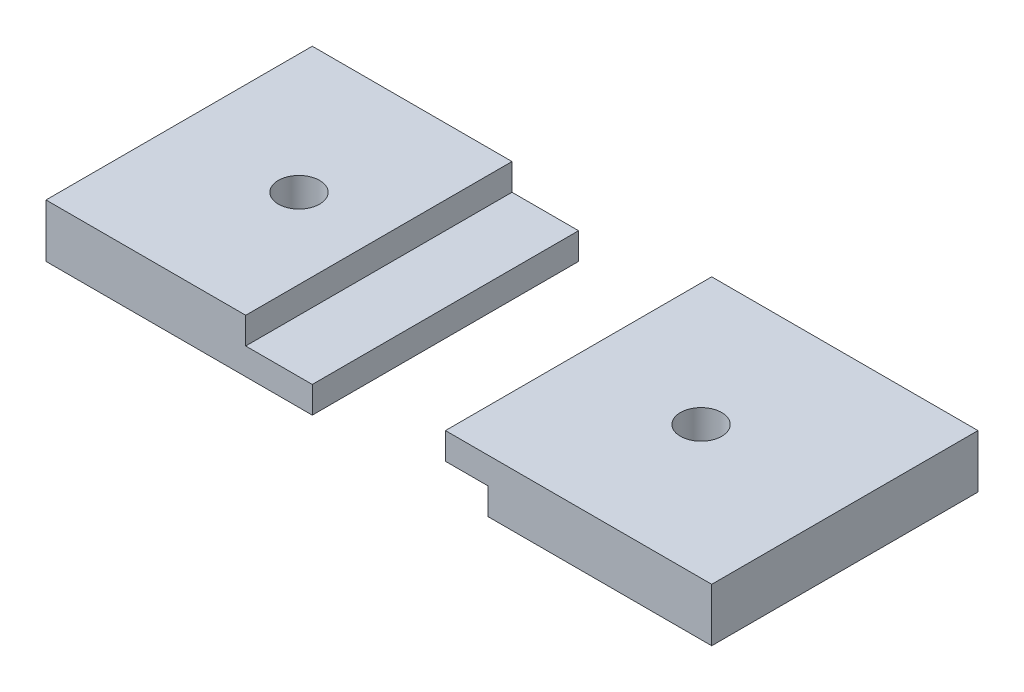
ISO-10303-21;
HEADER;
FILE_DESCRIPTION(('STEP AP214'),'2;1');
FILE_NAME('part.step','',(''),(''),'','','');
FILE_SCHEMA(('AUTOMOTIVE_DESIGN { 1 0 10303 214 1 1 1 1 }'));
ENDSEC;
DATA;
#1=APPLICATION_CONTEXT('core data for automotive mechanical design processes');
#2=APPLICATION_PROTOCOL_DEFINITION('international standard','automotive_design',2000,#1);
#3=PRODUCT_CONTEXT('',#1,'mechanical');
#4=PRODUCT('Part','Part','',(#3));
#5=PRODUCT_RELATED_PRODUCT_CATEGORY('part','',(#4));
#6=PRODUCT_DEFINITION_FORMATION('','',#4);
#7=PRODUCT_DEFINITION_CONTEXT('part definition',#1,'design');
#8=PRODUCT_DEFINITION('design','',#6,#7);
#9=PRODUCT_DEFINITION_SHAPE('','',#8);
#10=(LENGTH_UNIT() NAMED_UNIT(*) SI_UNIT(.MILLI.,.METRE.));
#11=(NAMED_UNIT(*) PLANE_ANGLE_UNIT() SI_UNIT($,.RADIAN.));
#12=(NAMED_UNIT(*) SI_UNIT($,.STERADIAN.) SOLID_ANGLE_UNIT());
#13=UNCERTAINTY_MEASURE_WITH_UNIT(LENGTH_MEASURE(1.E-05),#10,'distance_accuracy_value','');
#14=(GEOMETRIC_REPRESENTATION_CONTEXT(3) GLOBAL_UNCERTAINTY_ASSIGNED_CONTEXT((#13)) GLOBAL_UNIT_ASSIGNED_CONTEXT((#10,
#11,#12)) REPRESENTATION_CONTEXT('',''));
#15=CARTESIAN_POINT('',(0.,0.,0.));
#16=DIRECTION('',(0.,0.,1.));
#17=DIRECTION('',(1.,0.,0.));
#18=AXIS2_PLACEMENT_3D('',#15,#16,#17);
#19=CARTESIAN_POINT('',(10.,4.,0.));
#20=DIRECTION('',(1.,0.,0.));
#21=DIRECTION('',(0.,0.,-1.));
#22=AXIS2_PLACEMENT_3D('',#19,#20,#21);
#23=PLANE('',#22);
#24=DIRECTION('',(0.,-1.,0.));
#25=VECTOR('',#24,1.);
#26=CARTESIAN_POINT('',(10.,4.,-20.));
#27=LINE('',#26,#25);
#28=CARTESIAN_POINT('',(10.,4.,-20.));
#29=VERTEX_POINT('',#28);
#30=CARTESIAN_POINT('',(10.,2.,-20.));
#31=VERTEX_POINT('',#30);
#32=EDGE_CURVE('E135',#29,#31,#27,.T.);
#33=ORIENTED_EDGE('',*,*,#32,.T.);
#34=DIRECTION('',(0.,0.,-1.));
#35=VECTOR('',#34,1.);
#36=CARTESIAN_POINT('',(10.,2.,-20.));
#37=LINE('',#36,#35);
#38=CARTESIAN_POINT('',(10.,2.,0.));
#39=VERTEX_POINT('',#38);
#40=EDGE_CURVE('E146',#39,#31,#37,.T.);
#41=ORIENTED_EDGE('',*,*,#40,.F.);
#42=DIRECTION('',(0.,-1.,0.));
#43=VECTOR('',#42,1.);
#44=CARTESIAN_POINT('',(10.,4.,0.));
#45=LINE('',#44,#43);
#46=CARTESIAN_POINT('',(10.,4.,0.));
#47=VERTEX_POINT('',#46);
#48=EDGE_CURVE('E12',#47,#39,#45,.T.);
#49=ORIENTED_EDGE('',*,*,#48,.F.);
#50=DIRECTION('',(0.,0.,1.));
#51=VECTOR('',#50,1.);
#52=CARTESIAN_POINT('',(10.,4.,0.));
#53=LINE('',#52,#51);
#54=EDGE_CURVE('E134',#29,#47,#53,.T.);
#55=ORIENTED_EDGE('',*,*,#54,.F.);
#56=EDGE_LOOP('',(#33,#41,#49,#55));
#57=FACE_BOUND('',#56,.T.);
#58=ADVANCED_FACE('F47',(#57),#23,.F.);
#59=CARTESIAN_POINT('',(10.,4.,0.));
#60=DIRECTION('',(0.,0.,-1.));
#61=DIRECTION('',(-1.,0.,0.));
#62=AXIS2_PLACEMENT_3D('',#59,#60,#61);
#63=PLANE('',#62);
#64=ORIENTED_EDGE('',*,*,#48,.T.);
#65=DIRECTION('',(-1.,0.,0.));
#66=VECTOR('',#65,1.);
#67=CARTESIAN_POINT('',(13.2,2.,0.));
#68=LINE('',#67,#66);
#69=CARTESIAN_POINT('',(13.2,2.,0.));
#70=VERTEX_POINT('',#69);
#71=EDGE_CURVE('E120',#70,#39,#68,.T.);
#72=ORIENTED_EDGE('',*,*,#71,.F.);
#73=DIRECTION('',(0.,1.,0.));
#74=VECTOR('',#73,1.);
#75=CARTESIAN_POINT('',(13.2,0.,0.));
#76=LINE('',#75,#74);
#77=CARTESIAN_POINT('',(13.2,0.,0.));
#78=VERTEX_POINT('',#77);
#79=EDGE_CURVE('E110',#78,#70,#76,.T.);
#80=ORIENTED_EDGE('',*,*,#79,.F.);
#81=DIRECTION('',(1.,0.,0.));
#82=VECTOR('',#81,1.);
#83=CARTESIAN_POINT('',(10.,0.,0.));
#84=LINE('',#83,#82);
#85=CARTESIAN_POINT('',(30.,0.,0.));
#86=VERTEX_POINT('',#85);
#87=EDGE_CURVE('E119',#78,#86,#84,.T.);
#88=ORIENTED_EDGE('',*,*,#87,.T.);
#89=DIRECTION('',(0.,-1.,0.));
#90=VECTOR('',#89,1.);
#91=CARTESIAN_POINT('',(30.,4.,0.));
#92=LINE('',#91,#90);
#93=CARTESIAN_POINT('',(30.,4.,0.));
#94=VERTEX_POINT('',#93);
#95=EDGE_CURVE('E54',#94,#86,#92,.T.);
#96=ORIENTED_EDGE('',*,*,#95,.F.);
#97=DIRECTION('',(1.,0.,0.));
#98=VECTOR('',#97,1.);
#99=CARTESIAN_POINT('',(10.,4.,0.));
#100=LINE('',#99,#98);
#101=EDGE_CURVE('E93',#47,#94,#100,.T.);
#102=ORIENTED_EDGE('',*,*,#101,.F.);
#103=EDGE_LOOP('',(#64,#72,#80,#88,#96,#102));
#104=FACE_BOUND('',#103,.T.);
#105=ADVANCED_FACE('F118',(#104),#63,.F.);
#106=CARTESIAN_POINT('',(30.,4.,0.));
#107=DIRECTION('',(-1.,0.,0.));
#108=DIRECTION('',(0.,0.,1.));
#109=AXIS2_PLACEMENT_3D('',#106,#107,#108);
#110=PLANE('',#109);
#111=DIRECTION('',(0.,0.,-1.));
#112=VECTOR('',#111,1.);
#113=CARTESIAN_POINT('',(30.,0.,0.));
#114=LINE('',#113,#112);
#115=CARTESIAN_POINT('',(30.,0.,-20.));
#116=VERTEX_POINT('',#115);
#117=EDGE_CURVE('E86',#86,#116,#114,.T.);
#118=ORIENTED_EDGE('',*,*,#117,.T.);
#119=DIRECTION('',(0.,-1.,0.));
#120=VECTOR('',#119,1.);
#121=CARTESIAN_POINT('',(30.,4.,-20.));
#122=LINE('',#121,#120);
#123=CARTESIAN_POINT('',(30.,4.,-20.));
#124=VERTEX_POINT('',#123);
#125=EDGE_CURVE('E138',#124,#116,#122,.T.);
#126=ORIENTED_EDGE('',*,*,#125,.F.);
#127=DIRECTION('',(0.,0.,-1.));
#128=VECTOR('',#127,1.);
#129=CARTESIAN_POINT('',(30.,4.,0.));
#130=LINE('',#129,#128);
#131=EDGE_CURVE('E141',#94,#124,#130,.T.);
#132=ORIENTED_EDGE('',*,*,#131,.F.);
#133=ORIENTED_EDGE('',*,*,#95,.T.);
#134=EDGE_LOOP('',(#118,#126,#132,#133));
#135=FACE_BOUND('',#134,.T.);
#136=ADVANCED_FACE('F140',(#135),#110,.F.);
#137=CARTESIAN_POINT('',(10.,4.,-20.));
#138=DIRECTION('',(0.,0.,1.));
#139=DIRECTION('',(1.,0.,0.));
#140=AXIS2_PLACEMENT_3D('',#137,#138,#139);
#141=PLANE('',#140);
#142=DIRECTION('',(0.,-1.,0.));
#143=VECTOR('',#142,1.);
#144=CARTESIAN_POINT('',(13.2,0.,-20.));
#145=LINE('',#144,#143);
#146=CARTESIAN_POINT('',(13.2,2.,-20.));
#147=VERTEX_POINT('',#146);
#148=CARTESIAN_POINT('',(13.2,0.,-20.));
#149=VERTEX_POINT('',#148);
#150=EDGE_CURVE('E61',#147,#149,#145,.T.);
#151=ORIENTED_EDGE('',*,*,#150,.F.);
#152=DIRECTION('',(-1.,0.,0.));
#153=VECTOR('',#152,1.);
#154=CARTESIAN_POINT('',(13.2,2.,-20.));
#155=LINE('',#154,#153);
#156=EDGE_CURVE('E124',#147,#31,#155,.T.);
#157=ORIENTED_EDGE('',*,*,#156,.T.);
#158=ORIENTED_EDGE('',*,*,#32,.F.);
#159=DIRECTION('',(-1.,0.,0.));
#160=VECTOR('',#159,1.);
#161=CARTESIAN_POINT('',(10.,4.,-20.));
#162=LINE('',#161,#160);
#163=EDGE_CURVE('E70',#124,#29,#162,.T.);
#164=ORIENTED_EDGE('',*,*,#163,.F.);
#165=ORIENTED_EDGE('',*,*,#125,.T.);
#166=DIRECTION('',(-1.,0.,0.));
#167=VECTOR('',#166,1.);
#168=CARTESIAN_POINT('',(10.,0.,-20.));
#169=LINE('',#168,#167);
#170=EDGE_CURVE('E126',#116,#149,#169,.T.);
#171=ORIENTED_EDGE('',*,*,#170,.T.);
#172=EDGE_LOOP('',(#151,#157,#158,#164,#165,#171));
#173=FACE_BOUND('',#172,.T.);
#174=ADVANCED_FACE('F166',(#173),#141,.F.);
#175=CARTESIAN_POINT('',(0.,4.,0.));
#176=DIRECTION('',(0.,-1.,0.));
#177=DIRECTION('',(0.,0.,-1.));
#178=AXIS2_PLACEMENT_3D('',#175,#176,#177);
#179=PLANE('',#178);
#180=CARTESIAN_POINT('',(19.2,4.,-10.));
#181=DIRECTION('',(0.,1.,0.));
#182=DIRECTION('',(0.,0.,1.));
#183=AXIS2_PLACEMENT_3D('',#180,#181,#182);
#184=CIRCLE('',#183,1.55);
#185=CARTESIAN_POINT('',(19.2,4.,-8.45000000000001));
#186=VERTEX_POINT('',#185);
#187=EDGE_CURVE('E151',#186,#186,#184,.T.);
#188=ORIENTED_EDGE('',*,*,#187,.F.);
#189=EDGE_LOOP('',(#188));
#190=FACE_BOUND('',#189,.T.);
#191=ORIENTED_EDGE('',*,*,#54,.T.);
#192=ORIENTED_EDGE('',*,*,#101,.T.);
#193=ORIENTED_EDGE('',*,*,#131,.T.);
#194=ORIENTED_EDGE('',*,*,#163,.T.);
#195=EDGE_LOOP('',(#191,#192,#193,#194));
#196=FACE_BOUND('',#195,.T.);
#197=ADVANCED_FACE('F164',(#190,#196),#179,.F.);
#198=CARTESIAN_POINT('',(0.,0.,0.));
#199=DIRECTION('',(0.,-1.,0.));
#200=DIRECTION('',(0.,0.,-1.));
#201=AXIS2_PLACEMENT_3D('',#198,#199,#200);
#202=PLANE('',#201);
#203=CARTESIAN_POINT('',(19.2,0.,-10.));
#204=DIRECTION('',(0.,1.,0.));
#205=DIRECTION('',(0.,0.,1.));
#206=AXIS2_PLACEMENT_3D('',#203,#204,#205);
#207=CIRCLE('',#206,1.55);
#208=CARTESIAN_POINT('',(19.2,0.,-8.45000000000001));
#209=VERTEX_POINT('',#208);
#210=EDGE_CURVE('E148',#209,#209,#207,.T.);
#211=ORIENTED_EDGE('',*,*,#210,.T.);
#212=EDGE_LOOP('',(#211));
#213=FACE_BOUND('',#212,.T.);
#214=DIRECTION('',(0.,0.,1.));
#215=VECTOR('',#214,1.);
#216=CARTESIAN_POINT('',(13.2,0.,-20.));
#217=LINE('',#216,#215);
#218=EDGE_CURVE('E107',#149,#78,#217,.T.);
#219=ORIENTED_EDGE('',*,*,#218,.F.);
#220=ORIENTED_EDGE('',*,*,#170,.F.);
#221=ORIENTED_EDGE('',*,*,#117,.F.);
#222=ORIENTED_EDGE('',*,*,#87,.F.);
#223=EDGE_LOOP('',(#219,#220,#221,#222));
#224=FACE_BOUND('',#223,.T.);
#225=ADVANCED_FACE('F123',(#213,#224),#202,.T.);
#226=CARTESIAN_POINT('',(13.2,2.,-20.));
#227=DIRECTION('',(0.,1.,0.));
#228=DIRECTION('',(0.,0.,1.));
#229=AXIS2_PLACEMENT_3D('',#226,#227,#228);
#230=PLANE('',#229);
#231=ORIENTED_EDGE('',*,*,#40,.T.);
#232=ORIENTED_EDGE('',*,*,#156,.F.);
#233=DIRECTION('',(0.,0.,-1.));
#234=VECTOR('',#233,1.);
#235=CARTESIAN_POINT('',(13.2,2.,-20.));
#236=LINE('',#235,#234);
#237=EDGE_CURVE('E121',#70,#147,#236,.T.);
#238=ORIENTED_EDGE('',*,*,#237,.F.);
#239=ORIENTED_EDGE('',*,*,#71,.T.);
#240=EDGE_LOOP('',(#231,#232,#238,#239));
#241=FACE_BOUND('',#240,.T.);
#242=ADVANCED_FACE('F173',(#241),#230,.F.);
#243=CARTESIAN_POINT('',(13.2,0.,0.));
#244=DIRECTION('',(1.,0.,0.));
#245=DIRECTION('',(0.,0.,-1.));
#246=AXIS2_PLACEMENT_3D('',#243,#244,#245);
#247=PLANE('',#246);
#248=ORIENTED_EDGE('',*,*,#150,.T.);
#249=ORIENTED_EDGE('',*,*,#218,.T.);
#250=ORIENTED_EDGE('',*,*,#79,.T.);
#251=ORIENTED_EDGE('',*,*,#237,.T.);
#252=EDGE_LOOP('',(#248,#249,#250,#251));
#253=FACE_BOUND('',#252,.T.);
#254=ADVANCED_FACE('F109',(#253),#247,.F.);
#255=CARTESIAN_POINT('',(19.2,0.,-10.));
#256=DIRECTION('',(0.,1.,0.));
#257=DIRECTION('',(0.,0.,1.));
#258=AXIS2_PLACEMENT_3D('',#255,#256,#257);
#259=CYLINDRICAL_SURFACE('',#258,1.55);
#260=ORIENTED_EDGE('',*,*,#210,.F.);
#261=EDGE_LOOP('',(#260));
#262=FACE_BOUND('',#261,.T.);
#263=ORIENTED_EDGE('',*,*,#187,.T.);
#264=EDGE_LOOP('',(#263));
#265=FACE_BOUND('',#264,.T.);
#266=ADVANCED_FACE('F158',(#262,#265),#259,.F.);
#267=CLOSED_SHELL('',(#58,#105,#136,#174,#197,#225,#242,#254,#266));
#268=MANIFOLD_SOLID_BREP('B2',#267);
#269=CARTESIAN_POINT('',(0.,4.,0.));
#270=DIRECTION('',(0.,1.,0.));
#271=DIRECTION('',(0.,0.,1.));
#272=AXIS2_PLACEMENT_3D('',#269,#270,#271);
#273=PLANE('',#272);
#274=CARTESIAN_POINT('',(-11.,4.,-10.));
#275=DIRECTION('',(0.,1.,0.));
#276=DIRECTION('',(0.,0.,1.));
#277=AXIS2_PLACEMENT_3D('',#274,#275,#276);
#278=CIRCLE('',#277,1.55);
#279=CARTESIAN_POINT('',(-11.,4.,-8.45));
#280=VERTEX_POINT('',#279);
#281=EDGE_CURVE('E357',#280,#280,#278,.T.);
#282=ORIENTED_EDGE('',*,*,#281,.F.);
#283=EDGE_LOOP('',(#282));
#284=FACE_BOUND('',#283,.T.);
#285=DIRECTION('',(1.,0.,0.));
#286=VECTOR('',#285,1.);
#287=CARTESIAN_POINT('',(0.,4.,0.));
#288=LINE('',#287,#286);
#289=CARTESIAN_POINT('',(-20.,4.,0.));
#290=VERTEX_POINT('',#289);
#291=CARTESIAN_POINT('',(-5.,4.,0.));
#292=VERTEX_POINT('',#291);
#293=EDGE_CURVE('E298',#290,#292,#288,.T.);
#294=ORIENTED_EDGE('',*,*,#293,.T.);
#295=DIRECTION('',(0.,0.,1.));
#296=VECTOR('',#295,1.);
#297=CARTESIAN_POINT('',(-5.,4.,0.));
#298=LINE('',#297,#296);
#299=CARTESIAN_POINT('',(-5.,4.,-20.));
#300=VERTEX_POINT('',#299);
#301=EDGE_CURVE('E348',#300,#292,#298,.T.);
#302=ORIENTED_EDGE('',*,*,#301,.F.);
#303=DIRECTION('',(-1.,0.,0.));
#304=VECTOR('',#303,1.);
#305=CARTESIAN_POINT('',(0.,4.,-20.));
#306=LINE('',#305,#304);
#307=CARTESIAN_POINT('',(-20.,4.,-20.));
#308=VERTEX_POINT('',#307);
#309=EDGE_CURVE('E307',#300,#308,#306,.T.);
#310=ORIENTED_EDGE('',*,*,#309,.T.);
#311=DIRECTION('',(0.,0.,1.));
#312=VECTOR('',#311,1.);
#313=CARTESIAN_POINT('',(-20.,4.,0.));
#314=LINE('',#313,#312);
#315=EDGE_CURVE('E268',#308,#290,#314,.T.);
#316=ORIENTED_EDGE('',*,*,#315,.T.);
#317=EDGE_LOOP('',(#294,#302,#310,#316));
#318=FACE_BOUND('',#317,.T.);
#319=ADVANCED_FACE('F244',(#284,#318),#273,.T.);
#320=CARTESIAN_POINT('',(0.,4.,0.));
#321=DIRECTION('',(-1.,0.,0.));
#322=DIRECTION('',(0.,0.,1.));
#323=AXIS2_PLACEMENT_3D('',#320,#321,#322);
#324=PLANE('',#323);
#325=DIRECTION('',(0.,-1.,0.));
#326=VECTOR('',#325,1.);
#327=CARTESIAN_POINT('',(0.,4.,-20.));
#328=LINE('',#327,#326);
#329=CARTESIAN_POINT('',(0.,2.,-20.));
#330=VERTEX_POINT('',#329);
#331=CARTESIAN_POINT('',(0.,0.,-20.));
#332=VERTEX_POINT('',#331);
#333=EDGE_CURVE('E45',#330,#332,#328,.T.);
#334=ORIENTED_EDGE('',*,*,#333,.F.);
#335=DIRECTION('',(0.,0.,-1.));
#336=VECTOR('',#335,1.);
#337=CARTESIAN_POINT('',(0.,2.,0.));
#338=LINE('',#337,#336);
#339=CARTESIAN_POINT('',(0.,2.,0.));
#340=VERTEX_POINT('',#339);
#341=EDGE_CURVE('E294',#340,#330,#338,.T.);
#342=ORIENTED_EDGE('',*,*,#341,.F.);
#343=DIRECTION('',(0.,-1.,0.));
#344=VECTOR('',#343,1.);
#345=CARTESIAN_POINT('',(0.,4.,0.));
#346=LINE('',#345,#344);
#347=CARTESIAN_POINT('',(0.,0.,0.));
#348=VERTEX_POINT('',#347);
#349=EDGE_CURVE('E287',#340,#348,#346,.T.);
#350=ORIENTED_EDGE('',*,*,#349,.T.);
#351=DIRECTION('',(0.,0.,-1.));
#352=VECTOR('',#351,1.);
#353=CARTESIAN_POINT('',(0.,0.,0.));
#354=LINE('',#353,#352);
#355=EDGE_CURVE('E291',#348,#332,#354,.T.);
#356=ORIENTED_EDGE('',*,*,#355,.T.);
#357=EDGE_LOOP('',(#334,#342,#350,#356));
#358=FACE_BOUND('',#357,.T.);
#359=ADVANCED_FACE('F246',(#358),#324,.F.);
#360=CARTESIAN_POINT('',(0.,4.,-20.));
#361=DIRECTION('',(0.,0.,1.));
#362=DIRECTION('',(1.,0.,0.));
#363=AXIS2_PLACEMENT_3D('',#360,#361,#362);
#364=PLANE('',#363);
#365=DIRECTION('',(0.,1.,0.));
#366=VECTOR('',#365,1.);
#367=CARTESIAN_POINT('',(-5.,4.,-20.));
#368=LINE('',#367,#366);
#369=CARTESIAN_POINT('',(-5.,2.,-20.));
#370=VERTEX_POINT('',#369);
#371=EDGE_CURVE('E259',#370,#300,#368,.T.);
#372=ORIENTED_EDGE('',*,*,#371,.F.);
#373=DIRECTION('',(1.,0.,0.));
#374=VECTOR('',#373,1.);
#375=CARTESIAN_POINT('',(-5.,2.,-20.));
#376=LINE('',#375,#374);
#377=EDGE_CURVE('E313',#370,#330,#376,.T.);
#378=ORIENTED_EDGE('',*,*,#377,.T.);
#379=ORIENTED_EDGE('',*,*,#333,.T.);
#380=DIRECTION('',(-1.,0.,0.));
#381=VECTOR('',#380,1.);
#382=CARTESIAN_POINT('',(0.,0.,-20.));
#383=LINE('',#382,#381);
#384=CARTESIAN_POINT('',(-20.,0.,-20.));
#385=VERTEX_POINT('',#384);
#386=EDGE_CURVE('E312',#332,#385,#383,.T.);
#387=ORIENTED_EDGE('',*,*,#386,.T.);
#388=DIRECTION('',(0.,-1.,0.));
#389=VECTOR('',#388,1.);
#390=CARTESIAN_POINT('',(-20.,4.,-20.));
#391=LINE('',#390,#389);
#392=EDGE_CURVE('E252',#308,#385,#391,.T.);
#393=ORIENTED_EDGE('',*,*,#392,.F.);
#394=ORIENTED_EDGE('',*,*,#309,.F.);
#395=EDGE_LOOP('',(#372,#378,#379,#387,#393,#394));
#396=FACE_BOUND('',#395,.T.);
#397=ADVANCED_FACE('F329',(#396),#364,.F.);
#398=CARTESIAN_POINT('',(-20.,4.,0.));
#399=DIRECTION('',(1.,0.,0.));
#400=DIRECTION('',(0.,0.,-1.));
#401=AXIS2_PLACEMENT_3D('',#398,#399,#400);
#402=PLANE('',#401);
#403=DIRECTION('',(0.,0.,1.));
#404=VECTOR('',#403,1.);
#405=CARTESIAN_POINT('',(-20.,0.,0.));
#406=LINE('',#405,#404);
#407=CARTESIAN_POINT('',(-20.,0.,0.));
#408=VERTEX_POINT('',#407);
#409=EDGE_CURVE('E308',#385,#408,#406,.T.);
#410=ORIENTED_EDGE('',*,*,#409,.T.);
#411=DIRECTION('',(0.,-1.,0.));
#412=VECTOR('',#411,1.);
#413=CARTESIAN_POINT('',(-20.,4.,0.));
#414=LINE('',#413,#412);
#415=EDGE_CURVE('E297',#290,#408,#414,.T.);
#416=ORIENTED_EDGE('',*,*,#415,.F.);
#417=ORIENTED_EDGE('',*,*,#315,.F.);
#418=ORIENTED_EDGE('',*,*,#392,.T.);
#419=EDGE_LOOP('',(#410,#416,#417,#418));
#420=FACE_BOUND('',#419,.T.);
#421=ADVANCED_FACE('F326',(#420),#402,.F.);
#422=CARTESIAN_POINT('',(0.,4.,0.));
#423=DIRECTION('',(0.,0.,-1.));
#424=DIRECTION('',(-1.,0.,0.));
#425=AXIS2_PLACEMENT_3D('',#422,#423,#424);
#426=PLANE('',#425);
#427=ORIENTED_EDGE('',*,*,#349,.F.);
#428=DIRECTION('',(1.,0.,0.));
#429=VECTOR('',#428,1.);
#430=CARTESIAN_POINT('',(-5.,2.,0.));
#431=LINE('',#430,#429);
#432=CARTESIAN_POINT('',(-5.,2.,0.));
#433=VERTEX_POINT('',#432);
#434=EDGE_CURVE('E317',#433,#340,#431,.T.);
#435=ORIENTED_EDGE('',*,*,#434,.F.);
#436=DIRECTION('',(0.,-1.,0.));
#437=VECTOR('',#436,1.);
#438=CARTESIAN_POINT('',(-5.,4.,0.));
#439=LINE('',#438,#437);
#440=EDGE_CURVE('E346',#292,#433,#439,.T.);
#441=ORIENTED_EDGE('',*,*,#440,.F.);
#442=ORIENTED_EDGE('',*,*,#293,.F.);
#443=ORIENTED_EDGE('',*,*,#415,.T.);
#444=DIRECTION('',(1.,0.,0.));
#445=VECTOR('',#444,1.);
#446=CARTESIAN_POINT('',(0.,0.,0.));
#447=LINE('',#446,#445);
#448=EDGE_CURVE('E302',#408,#348,#447,.T.);
#449=ORIENTED_EDGE('',*,*,#448,.T.);
#450=EDGE_LOOP('',(#427,#435,#441,#442,#443,#449));
#451=FACE_BOUND('',#450,.T.);
#452=ADVANCED_FACE('F303',(#451),#426,.F.);
#453=CARTESIAN_POINT('',(0.,0.,0.));
#454=DIRECTION('',(0.,1.,0.));
#455=DIRECTION('',(0.,0.,1.));
#456=AXIS2_PLACEMENT_3D('',#453,#454,#455);
#457=PLANE('',#456);
#458=CARTESIAN_POINT('',(-11.,0.,-10.));
#459=DIRECTION('',(0.,1.,0.));
#460=DIRECTION('',(0.,0.,1.));
#461=AXIS2_PLACEMENT_3D('',#458,#459,#460);
#462=CIRCLE('',#461,1.55);
#463=CARTESIAN_POINT('',(-11.,0.,-8.45));
#464=VERTEX_POINT('',#463);
#465=EDGE_CURVE('E353',#464,#464,#462,.T.);
#466=ORIENTED_EDGE('',*,*,#465,.T.);
#467=EDGE_LOOP('',(#466));
#468=FACE_BOUND('',#467,.T.);
#469=ORIENTED_EDGE('',*,*,#355,.F.);
#470=ORIENTED_EDGE('',*,*,#448,.F.);
#471=ORIENTED_EDGE('',*,*,#409,.F.);
#472=ORIENTED_EDGE('',*,*,#386,.F.);
#473=EDGE_LOOP('',(#469,#470,#471,#472));
#474=FACE_BOUND('',#473,.T.);
#475=ADVANCED_FACE('F311',(#468,#474),#457,.F.);
#476=CARTESIAN_POINT('',(-5.,2.,0.));
#477=DIRECTION('',(0.,-1.,0.));
#478=DIRECTION('',(0.,0.,-1.));
#479=AXIS2_PLACEMENT_3D('',#476,#477,#478);
#480=PLANE('',#479);
#481=ORIENTED_EDGE('',*,*,#341,.T.);
#482=ORIENTED_EDGE('',*,*,#377,.F.);
#483=DIRECTION('',(0.,0.,-1.));
#484=VECTOR('',#483,1.);
#485=CARTESIAN_POINT('',(-5.,2.,0.));
#486=LINE('',#485,#484);
#487=EDGE_CURVE('E342',#433,#370,#486,.T.);
#488=ORIENTED_EDGE('',*,*,#487,.F.);
#489=ORIENTED_EDGE('',*,*,#434,.T.);
#490=EDGE_LOOP('',(#481,#482,#488,#489));
#491=FACE_BOUND('',#490,.T.);
#492=ADVANCED_FACE('F341',(#491),#480,.F.);
#493=CARTESIAN_POINT('',(-5.,0.,0.));
#494=DIRECTION('',(1.,0.,0.));
#495=DIRECTION('',(0.,0.,-1.));
#496=AXIS2_PLACEMENT_3D('',#493,#494,#495);
#497=PLANE('',#496);
#498=ORIENTED_EDGE('',*,*,#440,.T.);
#499=ORIENTED_EDGE('',*,*,#487,.T.);
#500=ORIENTED_EDGE('',*,*,#371,.T.);
#501=ORIENTED_EDGE('',*,*,#301,.T.);
#502=EDGE_LOOP('',(#498,#499,#500,#501));
#503=FACE_BOUND('',#502,.T.);
#504=ADVANCED_FACE('F344',(#503),#497,.T.);
#505=CARTESIAN_POINT('',(-11.,0.,-10.));
#506=DIRECTION('',(0.,1.,0.));
#507=DIRECTION('',(0.,0.,1.));
#508=AXIS2_PLACEMENT_3D('',#505,#506,#507);
#509=CYLINDRICAL_SURFACE('',#508,1.55);
#510=ORIENTED_EDGE('',*,*,#465,.F.);
#511=EDGE_LOOP('',(#510));
#512=FACE_BOUND('',#511,.T.);
#513=ORIENTED_EDGE('',*,*,#281,.T.);
#514=EDGE_LOOP('',(#513));
#515=FACE_BOUND('',#514,.T.);
#516=ADVANCED_FACE('F364',(#512,#515),#509,.F.);
#517=CLOSED_SHELL('',(#319,#359,#397,#421,#452,#475,#492,#504,#516));
#518=MANIFOLD_SOLID_BREP('B6',#517);
#519=ADVANCED_BREP_SHAPE_REPRESENTATION('',(#18,#268,#518),#14);
#520=SHAPE_DEFINITION_REPRESENTATION(#9,#519);
ENDSEC;
END-ISO-10303-21;
